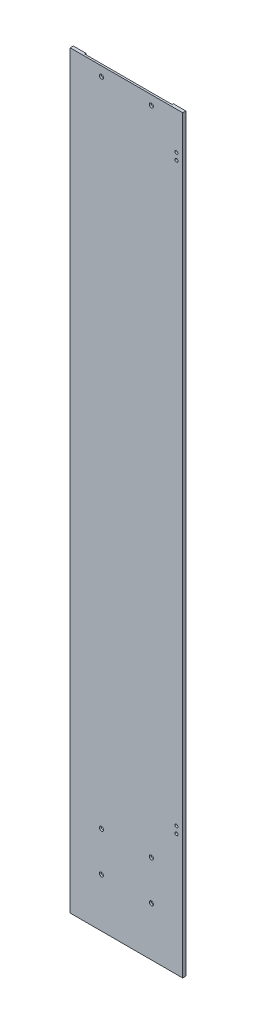
ISO-10303-21;
HEADER;
FILE_DESCRIPTION(('STEP AP214'),'2;1');
FILE_NAME('part.step','',(''),(''),'','','');
FILE_SCHEMA(('AUTOMOTIVE_DESIGN { 1 0 10303 214 1 1 1 1 }'));
ENDSEC;
DATA;
#1=APPLICATION_CONTEXT('core data for automotive mechanical design processes');
#2=APPLICATION_PROTOCOL_DEFINITION('international standard','automotive_design',2000,#1);
#3=PRODUCT_CONTEXT('',#1,'mechanical');
#4=PRODUCT('Part','Part','',(#3));
#5=PRODUCT_RELATED_PRODUCT_CATEGORY('part','',(#4));
#6=PRODUCT_DEFINITION_FORMATION('','',#4);
#7=PRODUCT_DEFINITION_CONTEXT('part definition',#1,'design');
#8=PRODUCT_DEFINITION('design','',#6,#7);
#9=PRODUCT_DEFINITION_SHAPE('','',#8);
#10=(LENGTH_UNIT() NAMED_UNIT(*) SI_UNIT(.MILLI.,.METRE.));
#11=(NAMED_UNIT(*) PLANE_ANGLE_UNIT() SI_UNIT($,.RADIAN.));
#12=(NAMED_UNIT(*) SI_UNIT($,.STERADIAN.) SOLID_ANGLE_UNIT());
#13=UNCERTAINTY_MEASURE_WITH_UNIT(LENGTH_MEASURE(1.E-05),#10,'distance_accuracy_value','');
#14=(GEOMETRIC_REPRESENTATION_CONTEXT(3) GLOBAL_UNCERTAINTY_ASSIGNED_CONTEXT((#13)) GLOBAL_UNIT_ASSIGNED_CONTEXT((#10,
#11,#12)) REPRESENTATION_CONTEXT('',''));
#15=CARTESIAN_POINT('',(0.,0.,0.));
#16=DIRECTION('',(0.,0.,1.));
#17=DIRECTION('',(1.,0.,0.));
#18=AXIS2_PLACEMENT_3D('',#15,#16,#17);
#19=CARTESIAN_POINT('',(0.,0.,0.));
#20=DIRECTION('',(0.,0.,1.));
#21=DIRECTION('',(1.,0.,0.));
#22=AXIS2_PLACEMENT_3D('',#19,#20,#21);
#23=PLANE('',#22);
#24=CARTESIAN_POINT('',(80.,539.95,0.));
#25=DIRECTION('',(0.,0.,-1.));
#26=DIRECTION('',(-1.,0.,0.));
#27=AXIS2_PLACEMENT_3D('',#24,#25,#26);
#28=CIRCLE('',#27,2.5);
#29=CARTESIAN_POINT('',(77.5,539.95,0.));
#30=VERTEX_POINT('',#29);
#31=EDGE_CURVE('E244',#30,#30,#28,.T.);
#32=ORIENTED_EDGE('',*,*,#31,.F.);
#33=EDGE_LOOP('',(#32));
#34=FACE_BOUND('',#33,.T.);
#35=CARTESIAN_POINT('',(80.,529.,0.));
#36=DIRECTION('',(0.,0.,-1.));
#37=DIRECTION('',(-1.,0.,0.));
#38=AXIS2_PLACEMENT_3D('',#35,#36,#37);
#39=CIRCLE('',#38,2.5);
#40=CARTESIAN_POINT('',(77.5,529.,0.));
#41=VERTEX_POINT('',#40);
#42=EDGE_CURVE('E238',#41,#41,#39,.T.);
#43=ORIENTED_EDGE('',*,*,#42,.F.);
#44=EDGE_LOOP('',(#43));
#45=FACE_BOUND('',#44,.T.);
#46=CARTESIAN_POINT('',(80.,-394.05,0.));
#47=DIRECTION('',(0.,0.,-1.));
#48=DIRECTION('',(-1.,0.,0.));
#49=AXIS2_PLACEMENT_3D('',#46,#47,#48);
#50=CIRCLE('',#49,2.50000000000001);
#51=CARTESIAN_POINT('',(77.5,-394.05,0.));
#52=VERTEX_POINT('',#51);
#53=EDGE_CURVE('E232',#52,#52,#50,.T.);
#54=ORIENTED_EDGE('',*,*,#53,.F.);
#55=EDGE_LOOP('',(#54));
#56=FACE_BOUND('',#55,.T.);
#57=CARTESIAN_POINT('',(80.,-405.,0.));
#58=DIRECTION('',(0.,0.,-1.));
#59=DIRECTION('',(-1.,0.,0.));
#60=AXIS2_PLACEMENT_3D('',#57,#58,#59);
#61=CIRCLE('',#60,2.5);
#62=CARTESIAN_POINT('',(77.5,-405.,0.));
#63=VERTEX_POINT('',#62);
#64=EDGE_CURVE('E226',#63,#63,#61,.T.);
#65=ORIENTED_EDGE('',*,*,#64,.F.);
#66=EDGE_LOOP('',(#65));
#67=FACE_BOUND('',#66,.T.);
#68=DIRECTION('',(1.,0.,0.));
#69=VECTOR('',#68,1.);
#70=CARTESIAN_POINT('',(-89.9999999999999,-600.,0.));
#71=LINE('',#70,#69);
#72=CARTESIAN_POINT('',(70.,-600.,0.));
#73=VERTEX_POINT('',#72);
#74=CARTESIAN_POINT('',(90.0000000000001,-600.,0.));
#75=VERTEX_POINT('',#74);
#76=EDGE_CURVE('E80',#73,#75,#71,.T.);
#77=ORIENTED_EDGE('',*,*,#76,.F.);
#78=DIRECTION('',(0.,-1.,0.));
#79=VECTOR('',#78,1.);
#80=CARTESIAN_POINT('',(70.,600.,0.));
#81=LINE('',#80,#79);
#82=CARTESIAN_POINT('',(70.,600.,0.));
#83=VERTEX_POINT('',#82);
#84=EDGE_CURVE('E113',#83,#73,#81,.T.);
#85=ORIENTED_EDGE('',*,*,#84,.F.);
#86=DIRECTION('',(-1.,0.,0.));
#87=VECTOR('',#86,1.);
#88=CARTESIAN_POINT('',(-90.0000000000001,600.,0.));
#89=LINE('',#88,#87);
#90=CARTESIAN_POINT('',(89.9999999999999,600.,0.));
#91=VERTEX_POINT('',#90);
#92=EDGE_CURVE('E154',#91,#83,#89,.T.);
#93=ORIENTED_EDGE('',*,*,#92,.F.);
#94=DIRECTION('',(0.,1.,0.));
#95=VECTOR('',#94,1.);
#96=CARTESIAN_POINT('',(89.9999999999999,600.,0.));
#97=LINE('',#96,#95);
#98=EDGE_CURVE('E138',#75,#91,#97,.T.);
#99=ORIENTED_EDGE('',*,*,#98,.F.);
#100=EDGE_LOOP('',(#77,#85,#93,#99));
#101=FACE_BOUND('',#100,.T.);
#102=ADVANCED_FACE('F33',(#34,#45,#56,#67,#101),#23,.F.);
#103=CARTESIAN_POINT('',(89.9999999999999,600.,5.));
#104=DIRECTION('',(-1.,0.,0.));
#105=DIRECTION('',(0.,-1.,0.));
#106=AXIS2_PLACEMENT_3D('',#103,#104,#105);
#107=PLANE('',#106);
#108=ORIENTED_EDGE('',*,*,#98,.T.);
#109=DIRECTION('',(0.,0.,-1.));
#110=VECTOR('',#109,1.);
#111=CARTESIAN_POINT('',(89.9999999999999,600.,5.));
#112=LINE('',#111,#110);
#113=CARTESIAN_POINT('',(89.9999999999999,600.,5.));
#114=VERTEX_POINT('',#113);
#115=EDGE_CURVE('E11',#114,#91,#112,.T.);
#116=ORIENTED_EDGE('',*,*,#115,.F.);
#117=DIRECTION('',(0.,1.,0.));
#118=VECTOR('',#117,1.);
#119=CARTESIAN_POINT('',(89.9999999999999,600.,5.));
#120=LINE('',#119,#118);
#121=CARTESIAN_POINT('',(90.0000000000001,-600.,5.));
#122=VERTEX_POINT('',#121);
#123=EDGE_CURVE('E143',#122,#114,#120,.T.);
#124=ORIENTED_EDGE('',*,*,#123,.F.);
#125=DIRECTION('',(0.,0.,-1.));
#126=VECTOR('',#125,1.);
#127=CARTESIAN_POINT('',(90.0000000000001,-600.,5.));
#128=LINE('',#127,#126);
#129=EDGE_CURVE('E150',#122,#75,#128,.T.);
#130=ORIENTED_EDGE('',*,*,#129,.T.);
#131=EDGE_LOOP('',(#108,#116,#124,#130));
#132=FACE_BOUND('',#131,.T.);
#133=ADVANCED_FACE('F35',(#132),#107,.F.);
#134=CARTESIAN_POINT('',(-90.0000000000001,600.,5.));
#135=DIRECTION('',(0.,-1.,0.));
#136=DIRECTION('',(0.,0.,-1.));
#137=AXIS2_PLACEMENT_3D('',#134,#135,#136);
#138=PLANE('',#137);
#139=ORIENTED_EDGE('',*,*,#92,.T.);
#140=DIRECTION('',(0.,0.,-1.));
#141=VECTOR('',#140,1.);
#142=CARTESIAN_POINT('',(70.,600.,2.));
#143=LINE('',#142,#141);
#144=CARTESIAN_POINT('',(70.,600.,2.));
#145=VERTEX_POINT('',#144);
#146=EDGE_CURVE('E136',#145,#83,#143,.T.);
#147=ORIENTED_EDGE('',*,*,#146,.F.);
#148=DIRECTION('',(1.,0.,0.));
#149=VECTOR('',#148,1.);
#150=CARTESIAN_POINT('',(70.,600.,2.));
#151=LINE('',#150,#149);
#152=CARTESIAN_POINT('',(-70.,600.,2.));
#153=VERTEX_POINT('',#152);
#154=EDGE_CURVE('E115',#153,#145,#151,.T.);
#155=ORIENTED_EDGE('',*,*,#154,.F.);
#156=DIRECTION('',(0.,0.,-1.));
#157=VECTOR('',#156,1.);
#158=CARTESIAN_POINT('',(-70.,600.,2.));
#159=LINE('',#158,#157);
#160=CARTESIAN_POINT('',(-70.,600.,0.));
#161=VERTEX_POINT('',#160);
#162=EDGE_CURVE('E139',#153,#161,#159,.T.);
#163=ORIENTED_EDGE('',*,*,#162,.T.);
#164=CARTESIAN_POINT('',(-90.0000000000001,600.,0.));
#165=VERTEX_POINT('',#164);
#166=EDGE_CURVE('E153',#161,#165,#89,.T.);
#167=ORIENTED_EDGE('',*,*,#166,.T.);
#168=DIRECTION('',(0.,0.,-1.));
#169=VECTOR('',#168,1.);
#170=CARTESIAN_POINT('',(-90.0000000000001,600.,5.));
#171=LINE('',#170,#169);
#172=CARTESIAN_POINT('',(-90.0000000000001,600.,5.));
#173=VERTEX_POINT('',#172);
#174=EDGE_CURVE('E42',#173,#165,#171,.T.);
#175=ORIENTED_EDGE('',*,*,#174,.F.);
#176=DIRECTION('',(-1.,0.,0.));
#177=VECTOR('',#176,1.);
#178=CARTESIAN_POINT('',(-90.0000000000001,600.,5.));
#179=LINE('',#178,#177);
#180=EDGE_CURVE('E87',#114,#173,#179,.T.);
#181=ORIENTED_EDGE('',*,*,#180,.F.);
#182=ORIENTED_EDGE('',*,*,#115,.T.);
#183=EDGE_LOOP('',(#139,#147,#155,#163,#167,#175,#181,#182));
#184=FACE_BOUND('',#183,.T.);
#185=ADVANCED_FACE('F281',(#184),#138,.F.);
#186=CARTESIAN_POINT('',(-90.0000000000001,600.,5.));
#187=DIRECTION('',(1.,0.,0.));
#188=DIRECTION('',(0.,1.,0.));
#189=AXIS2_PLACEMENT_3D('',#186,#187,#188);
#190=PLANE('',#189);
#191=DIRECTION('',(0.,-1.,0.));
#192=VECTOR('',#191,1.);
#193=CARTESIAN_POINT('',(-90.0000000000001,600.,0.));
#194=LINE('',#193,#192);
#195=CARTESIAN_POINT('',(-89.9999999999999,-600.,0.));
#196=VERTEX_POINT('',#195);
#197=EDGE_CURVE('E157',#165,#196,#194,.T.);
#198=ORIENTED_EDGE('',*,*,#197,.T.);
#199=DIRECTION('',(0.,0.,-1.));
#200=VECTOR('',#199,1.);
#201=CARTESIAN_POINT('',(-89.9999999999999,-600.,5.));
#202=LINE('',#201,#200);
#203=CARTESIAN_POINT('',(-89.9999999999999,-600.,5.));
#204=VERTEX_POINT('',#203);
#205=EDGE_CURVE('E161',#204,#196,#202,.T.);
#206=ORIENTED_EDGE('',*,*,#205,.F.);
#207=DIRECTION('',(0.,-1.,0.));
#208=VECTOR('',#207,1.);
#209=CARTESIAN_POINT('',(-90.0000000000001,600.,5.));
#210=LINE('',#209,#208);
#211=EDGE_CURVE('E147',#173,#204,#210,.T.);
#212=ORIENTED_EDGE('',*,*,#211,.F.);
#213=ORIENTED_EDGE('',*,*,#174,.T.);
#214=EDGE_LOOP('',(#198,#206,#212,#213));
#215=FACE_BOUND('',#214,.T.);
#216=ADVANCED_FACE('F282',(#215),#190,.F.);
#217=CARTESIAN_POINT('',(-89.9999999999999,-600.,5.));
#218=DIRECTION('',(0.,1.,0.));
#219=DIRECTION('',(0.,0.,1.));
#220=AXIS2_PLACEMENT_3D('',#217,#218,#219);
#221=PLANE('',#220);
#222=DIRECTION('',(-1.,0.,0.));
#223=VECTOR('',#222,1.);
#224=CARTESIAN_POINT('',(70.,-600.,2.));
#225=LINE('',#224,#223);
#226=CARTESIAN_POINT('',(70.,-600.,2.));
#227=VERTEX_POINT('',#226);
#228=CARTESIAN_POINT('',(-70.,-600.,2.));
#229=VERTEX_POINT('',#228);
#230=EDGE_CURVE('E121',#227,#229,#225,.T.);
#231=ORIENTED_EDGE('',*,*,#230,.F.);
#232=DIRECTION('',(0.,0.,-1.));
#233=VECTOR('',#232,1.);
#234=CARTESIAN_POINT('',(70.,-600.,2.));
#235=LINE('',#234,#233);
#236=EDGE_CURVE('E107',#227,#73,#235,.T.);
#237=ORIENTED_EDGE('',*,*,#236,.T.);
#238=ORIENTED_EDGE('',*,*,#76,.T.);
#239=ORIENTED_EDGE('',*,*,#129,.F.);
#240=DIRECTION('',(1.,0.,0.));
#241=VECTOR('',#240,1.);
#242=CARTESIAN_POINT('',(-89.9999999999999,-600.,5.));
#243=LINE('',#242,#241);
#244=EDGE_CURVE('E59',#204,#122,#243,.T.);
#245=ORIENTED_EDGE('',*,*,#244,.F.);
#246=ORIENTED_EDGE('',*,*,#205,.T.);
#247=CARTESIAN_POINT('',(-70.,-600.,0.));
#248=VERTEX_POINT('',#247);
#249=EDGE_CURVE('E145',#196,#248,#71,.T.);
#250=ORIENTED_EDGE('',*,*,#249,.T.);
#251=DIRECTION('',(0.,0.,-1.));
#252=VECTOR('',#251,1.);
#253=CARTESIAN_POINT('',(-70.,-600.,2.));
#254=LINE('',#253,#252);
#255=EDGE_CURVE('E50',#229,#248,#254,.T.);
#256=ORIENTED_EDGE('',*,*,#255,.F.);
#257=EDGE_LOOP('',(#231,#237,#238,#239,#245,#246,#250,#256));
#258=FACE_BOUND('',#257,.T.);
#259=ADVANCED_FACE('F126',(#258),#221,.F.);
#260=CARTESIAN_POINT('',(0.,0.,5.));
#261=DIRECTION('',(0.,0.,1.));
#262=DIRECTION('',(1.,0.,0.));
#263=AXIS2_PLACEMENT_3D('',#260,#261,#262);
#264=PLANE('',#263);
#265=CARTESIAN_POINT('',(80.,539.95,5.));
#266=DIRECTION('',(0.,0.,-1.));
#267=DIRECTION('',(-1.,0.,0.));
#268=AXIS2_PLACEMENT_3D('',#265,#266,#267);
#269=CIRCLE('',#268,2.5);
#270=CARTESIAN_POINT('',(77.5,539.95,5.));
#271=VERTEX_POINT('',#270);
#272=EDGE_CURVE('E218',#271,#271,#269,.T.);
#273=ORIENTED_EDGE('',*,*,#272,.T.);
#274=EDGE_LOOP('',(#273));
#275=FACE_BOUND('',#274,.T.);
#276=CARTESIAN_POINT('',(80.,529.,5.));
#277=DIRECTION('',(0.,0.,-1.));
#278=DIRECTION('',(-1.,0.,0.));
#279=AXIS2_PLACEMENT_3D('',#276,#277,#278);
#280=CIRCLE('',#279,2.5);
#281=CARTESIAN_POINT('',(77.5,529.,5.));
#282=VERTEX_POINT('',#281);
#283=EDGE_CURVE('E241',#282,#282,#280,.T.);
#284=ORIENTED_EDGE('',*,*,#283,.T.);
#285=EDGE_LOOP('',(#284));
#286=FACE_BOUND('',#285,.T.);
#287=CARTESIAN_POINT('',(80.,-394.05,5.));
#288=DIRECTION('',(0.,0.,-1.));
#289=DIRECTION('',(-1.,0.,0.));
#290=AXIS2_PLACEMENT_3D('',#287,#288,#289);
#291=CIRCLE('',#290,2.50000000000001);
#292=CARTESIAN_POINT('',(77.5,-394.05,5.));
#293=VERTEX_POINT('',#292);
#294=EDGE_CURVE('E235',#293,#293,#291,.T.);
#295=ORIENTED_EDGE('',*,*,#294,.T.);
#296=EDGE_LOOP('',(#295));
#297=FACE_BOUND('',#296,.T.);
#298=CARTESIAN_POINT('',(80.,-405.,5.));
#299=DIRECTION('',(0.,0.,-1.));
#300=DIRECTION('',(-1.,0.,0.));
#301=AXIS2_PLACEMENT_3D('',#298,#299,#300);
#302=CIRCLE('',#301,2.5);
#303=CARTESIAN_POINT('',(77.5,-405.,5.));
#304=VERTEX_POINT('',#303);
#305=EDGE_CURVE('E229',#304,#304,#302,.T.);
#306=ORIENTED_EDGE('',*,*,#305,.T.);
#307=EDGE_LOOP('',(#306));
#308=FACE_BOUND('',#307,.T.);
#309=CARTESIAN_POINT('',(40.,-521.5,5.));
#310=DIRECTION('',(0.,0.,1.));
#311=DIRECTION('',(-1.,0.,0.));
#312=AXIS2_PLACEMENT_3D('',#309,#310,#311);
#313=CIRCLE('',#312,3.30000000000002);
#314=CARTESIAN_POINT('',(36.7,-521.5,5.));
#315=VERTEX_POINT('',#314);
#316=EDGE_CURVE('E214',#315,#315,#313,.T.);
#317=ORIENTED_EDGE('',*,*,#316,.F.);
#318=EDGE_LOOP('',(#317));
#319=FACE_BOUND('',#318,.T.);
#320=CARTESIAN_POINT('',(40.,-458.,5.));
#321=DIRECTION('',(0.,0.,1.));
#322=DIRECTION('',(-1.,0.,0.));
#323=AXIS2_PLACEMENT_3D('',#320,#321,#322);
#324=CIRCLE('',#323,3.30000000000002);
#325=CARTESIAN_POINT('',(36.7,-458.,5.));
#326=VERTEX_POINT('',#325);
#327=EDGE_CURVE('E217',#326,#326,#324,.T.);
#328=ORIENTED_EDGE('',*,*,#327,.F.);
#329=EDGE_LOOP('',(#328));
#330=FACE_BOUND('',#329,.T.);
#331=CARTESIAN_POINT('',(40.,585.,5.));
#332=DIRECTION('',(0.,0.,1.));
#333=DIRECTION('',(-1.,0.,0.));
#334=AXIS2_PLACEMENT_3D('',#331,#332,#333);
#335=CIRCLE('',#334,3.30000000000002);
#336=CARTESIAN_POINT('',(36.7,585.,5.));
#337=VERTEX_POINT('',#336);
#338=EDGE_CURVE('E221',#337,#337,#335,.T.);
#339=ORIENTED_EDGE('',*,*,#338,.F.);
#340=EDGE_LOOP('',(#339));
#341=FACE_BOUND('',#340,.T.);
#342=CARTESIAN_POINT('',(-40.,585.,5.));
#343=DIRECTION('',(0.,0.,1.));
#344=DIRECTION('',(1.,0.,0.));
#345=AXIS2_PLACEMENT_3D('',#342,#343,#344);
#346=CIRCLE('',#345,3.30000000000002);
#347=CARTESIAN_POINT('',(-36.7,585.,5.));
#348=VERTEX_POINT('',#347);
#349=EDGE_CURVE('E211',#348,#348,#346,.T.);
#350=ORIENTED_EDGE('',*,*,#349,.F.);
#351=EDGE_LOOP('',(#350));
#352=FACE_BOUND('',#351,.T.);
#353=CARTESIAN_POINT('',(-40.,-458.,5.));
#354=DIRECTION('',(0.,0.,1.));
#355=DIRECTION('',(1.,0.,0.));
#356=AXIS2_PLACEMENT_3D('',#353,#354,#355);
#357=CIRCLE('',#356,3.30000000000002);
#358=CARTESIAN_POINT('',(-36.7,-458.,5.));
#359=VERTEX_POINT('',#358);
#360=EDGE_CURVE('E209',#359,#359,#357,.T.);
#361=ORIENTED_EDGE('',*,*,#360,.F.);
#362=EDGE_LOOP('',(#361));
#363=FACE_BOUND('',#362,.T.);
#364=CARTESIAN_POINT('',(-40.,-521.5,5.));
#365=DIRECTION('',(0.,0.,1.));
#366=DIRECTION('',(1.,0.,0.));
#367=AXIS2_PLACEMENT_3D('',#364,#365,#366);
#368=CIRCLE('',#367,3.30000000000002);
#369=CARTESIAN_POINT('',(-36.7,-521.5,5.));
#370=VERTEX_POINT('',#369);
#371=EDGE_CURVE('E170',#370,#370,#368,.T.);
#372=ORIENTED_EDGE('',*,*,#371,.F.);
#373=EDGE_LOOP('',(#372));
#374=FACE_BOUND('',#373,.T.);
#375=ORIENTED_EDGE('',*,*,#123,.T.);
#376=ORIENTED_EDGE('',*,*,#180,.T.);
#377=ORIENTED_EDGE('',*,*,#211,.T.);
#378=ORIENTED_EDGE('',*,*,#244,.T.);
#379=EDGE_LOOP('',(#375,#376,#377,#378));
#380=FACE_BOUND('',#379,.T.);
#381=ADVANCED_FACE('F250',(#275,#286,#297,#308,#319,#330,#341,#352,#363,#374,#380),#264,.T.);
#382=ORIENTED_EDGE('',*,*,#166,.F.);
#383=DIRECTION('',(0.,1.,0.));
#384=VECTOR('',#383,1.);
#385=CARTESIAN_POINT('',(-70.,600.,0.));
#386=LINE('',#385,#384);
#387=EDGE_CURVE('E124',#248,#161,#386,.T.);
#388=ORIENTED_EDGE('',*,*,#387,.F.);
#389=ORIENTED_EDGE('',*,*,#249,.F.);
#390=ORIENTED_EDGE('',*,*,#197,.F.);
#391=EDGE_LOOP('',(#382,#388,#389,#390));
#392=FACE_BOUND('',#391,.T.);
#393=ADVANCED_FACE('F263',(#392),#23,.F.);
#394=CARTESIAN_POINT('',(70.,600.,2.));
#395=DIRECTION('',(1.,0.,0.));
#396=DIRECTION('',(0.,0.,-1.));
#397=AXIS2_PLACEMENT_3D('',#394,#395,#396);
#398=PLANE('',#397);
#399=ORIENTED_EDGE('',*,*,#84,.T.);
#400=ORIENTED_EDGE('',*,*,#236,.F.);
#401=DIRECTION('',(0.,-1.,0.));
#402=VECTOR('',#401,1.);
#403=CARTESIAN_POINT('',(70.,600.,2.));
#404=LINE('',#403,#402);
#405=EDGE_CURVE('E110',#145,#227,#404,.T.);
#406=ORIENTED_EDGE('',*,*,#405,.F.);
#407=ORIENTED_EDGE('',*,*,#146,.T.);
#408=EDGE_LOOP('',(#399,#400,#406,#407));
#409=FACE_BOUND('',#408,.T.);
#410=ADVANCED_FACE('F109',(#409),#398,.F.);
#411=CARTESIAN_POINT('',(-70.,600.,2.));
#412=DIRECTION('',(-1.,0.,0.));
#413=DIRECTION('',(0.,0.,1.));
#414=AXIS2_PLACEMENT_3D('',#411,#412,#413);
#415=PLANE('',#414);
#416=ORIENTED_EDGE('',*,*,#387,.T.);
#417=ORIENTED_EDGE('',*,*,#162,.F.);
#418=DIRECTION('',(0.,1.,0.));
#419=VECTOR('',#418,1.);
#420=CARTESIAN_POINT('',(-70.,600.,2.));
#421=LINE('',#420,#419);
#422=EDGE_CURVE('E128',#229,#153,#421,.T.);
#423=ORIENTED_EDGE('',*,*,#422,.F.);
#424=ORIENTED_EDGE('',*,*,#255,.T.);
#425=EDGE_LOOP('',(#416,#417,#423,#424));
#426=FACE_BOUND('',#425,.T.);
#427=ADVANCED_FACE('F191',(#426),#415,.F.);
#428=CARTESIAN_POINT('',(0.,0.,2.));
#429=DIRECTION('',(0.,0.,-1.));
#430=DIRECTION('',(-1.,0.,0.));
#431=AXIS2_PLACEMENT_3D('',#428,#429,#430);
#432=PLANE('',#431);
#433=CARTESIAN_POINT('',(40.,-521.5,2.));
#434=DIRECTION('',(0.,0.,-1.));
#435=DIRECTION('',(-1.,0.,0.));
#436=AXIS2_PLACEMENT_3D('',#433,#434,#435);
#437=CIRCLE('',#436,3.30000000000002);
#438=CARTESIAN_POINT('',(36.7,-521.5,2.));
#439=VERTEX_POINT('',#438);
#440=EDGE_CURVE('E37',#439,#439,#437,.T.);
#441=ORIENTED_EDGE('',*,*,#440,.F.);
#442=EDGE_LOOP('',(#441));
#443=FACE_BOUND('',#442,.T.);
#444=CARTESIAN_POINT('',(40.,-458.,2.));
#445=DIRECTION('',(0.,0.,-1.));
#446=DIRECTION('',(-1.,0.,0.));
#447=AXIS2_PLACEMENT_3D('',#444,#445,#446);
#448=CIRCLE('',#447,3.30000000000002);
#449=CARTESIAN_POINT('',(36.7,-458.,2.));
#450=VERTEX_POINT('',#449);
#451=EDGE_CURVE('E178',#450,#450,#448,.T.);
#452=ORIENTED_EDGE('',*,*,#451,.F.);
#453=EDGE_LOOP('',(#452));
#454=FACE_BOUND('',#453,.T.);
#455=CARTESIAN_POINT('',(40.,585.,2.));
#456=DIRECTION('',(0.,0.,-1.));
#457=DIRECTION('',(-1.,0.,0.));
#458=AXIS2_PLACEMENT_3D('',#455,#456,#457);
#459=CIRCLE('',#458,3.30000000000002);
#460=CARTESIAN_POINT('',(36.7,585.,2.));
#461=VERTEX_POINT('',#460);
#462=EDGE_CURVE('E176',#461,#461,#459,.T.);
#463=ORIENTED_EDGE('',*,*,#462,.F.);
#464=EDGE_LOOP('',(#463));
#465=FACE_BOUND('',#464,.T.);
#466=CARTESIAN_POINT('',(-40.,585.,2.));
#467=DIRECTION('',(0.,0.,-1.));
#468=DIRECTION('',(-1.,0.,0.));
#469=AXIS2_PLACEMENT_3D('',#466,#467,#468);
#470=CIRCLE('',#469,3.30000000000002);
#471=CARTESIAN_POINT('',(-43.3,585.,2.));
#472=VERTEX_POINT('',#471);
#473=EDGE_CURVE('E173',#472,#472,#470,.T.);
#474=ORIENTED_EDGE('',*,*,#473,.F.);
#475=EDGE_LOOP('',(#474));
#476=FACE_BOUND('',#475,.T.);
#477=CARTESIAN_POINT('',(-40.,-458.,2.));
#478=DIRECTION('',(0.,0.,-1.));
#479=DIRECTION('',(-1.,0.,0.));
#480=AXIS2_PLACEMENT_3D('',#477,#478,#479);
#481=CIRCLE('',#480,3.30000000000002);
#482=CARTESIAN_POINT('',(-43.3,-458.,2.));
#483=VERTEX_POINT('',#482);
#484=EDGE_CURVE('E169',#483,#483,#481,.T.);
#485=ORIENTED_EDGE('',*,*,#484,.F.);
#486=EDGE_LOOP('',(#485));
#487=FACE_BOUND('',#486,.T.);
#488=CARTESIAN_POINT('',(-40.,-521.5,2.));
#489=DIRECTION('',(0.,0.,-1.));
#490=DIRECTION('',(-1.,0.,0.));
#491=AXIS2_PLACEMENT_3D('',#488,#489,#490);
#492=CIRCLE('',#491,3.30000000000002);
#493=CARTESIAN_POINT('',(-43.3,-521.5,2.));
#494=VERTEX_POINT('',#493);
#495=EDGE_CURVE('E166',#494,#494,#492,.T.);
#496=ORIENTED_EDGE('',*,*,#495,.F.);
#497=EDGE_LOOP('',(#496));
#498=FACE_BOUND('',#497,.T.);
#499=ORIENTED_EDGE('',*,*,#405,.T.);
#500=ORIENTED_EDGE('',*,*,#230,.T.);
#501=ORIENTED_EDGE('',*,*,#422,.T.);
#502=ORIENTED_EDGE('',*,*,#154,.T.);
#503=EDGE_LOOP('',(#499,#500,#501,#502));
#504=FACE_BOUND('',#503,.T.);
#505=ADVANCED_FACE('F119',(#443,#454,#465,#476,#487,#498,#504),#432,.T.);
#506=CARTESIAN_POINT('',(-40.,-521.5,0.));
#507=DIRECTION('',(0.,0.,1.));
#508=DIRECTION('',(1.,0.,0.));
#509=AXIS2_PLACEMENT_3D('',#506,#507,#508);
#510=CYLINDRICAL_SURFACE('',#509,3.30000000000002);
#511=ORIENTED_EDGE('',*,*,#495,.T.);
#512=EDGE_LOOP('',(#511));
#513=FACE_BOUND('',#512,.T.);
#514=ORIENTED_EDGE('',*,*,#371,.T.);
#515=EDGE_LOOP('',(#514));
#516=FACE_BOUND('',#515,.T.);
#517=ADVANCED_FACE('F190',(#513,#516),#510,.F.);
#518=CARTESIAN_POINT('',(-40.,-458.,0.));
#519=DIRECTION('',(0.,0.,1.));
#520=DIRECTION('',(1.,0.,0.));
#521=AXIS2_PLACEMENT_3D('',#518,#519,#520);
#522=CYLINDRICAL_SURFACE('',#521,3.30000000000002);
#523=ORIENTED_EDGE('',*,*,#484,.T.);
#524=EDGE_LOOP('',(#523));
#525=FACE_BOUND('',#524,.T.);
#526=ORIENTED_EDGE('',*,*,#360,.T.);
#527=EDGE_LOOP('',(#526));
#528=FACE_BOUND('',#527,.T.);
#529=ADVANCED_FACE('F204',(#525,#528),#522,.F.);
#530=CARTESIAN_POINT('',(-40.,585.,0.));
#531=DIRECTION('',(0.,0.,1.));
#532=DIRECTION('',(1.,0.,0.));
#533=AXIS2_PLACEMENT_3D('',#530,#531,#532);
#534=CYLINDRICAL_SURFACE('',#533,3.30000000000002);
#535=ORIENTED_EDGE('',*,*,#473,.T.);
#536=EDGE_LOOP('',(#535));
#537=FACE_BOUND('',#536,.T.);
#538=ORIENTED_EDGE('',*,*,#349,.T.);
#539=EDGE_LOOP('',(#538));
#540=FACE_BOUND('',#539,.T.);
#541=ADVANCED_FACE('F338',(#537,#540),#534,.F.);
#542=CARTESIAN_POINT('',(40.,585.,0.));
#543=DIRECTION('',(0.,0.,1.));
#544=DIRECTION('',(1.,0.,0.));
#545=AXIS2_PLACEMENT_3D('',#542,#543,#544);
#546=CYLINDRICAL_SURFACE('',#545,3.30000000000002);
#547=ORIENTED_EDGE('',*,*,#462,.T.);
#548=EDGE_LOOP('',(#547));
#549=FACE_BOUND('',#548,.T.);
#550=ORIENTED_EDGE('',*,*,#338,.T.);
#551=EDGE_LOOP('',(#550));
#552=FACE_BOUND('',#551,.T.);
#553=ADVANCED_FACE('F329',(#549,#552),#546,.F.);
#554=CARTESIAN_POINT('',(40.,-458.,0.));
#555=DIRECTION('',(0.,0.,1.));
#556=DIRECTION('',(1.,0.,0.));
#557=AXIS2_PLACEMENT_3D('',#554,#555,#556);
#558=CYLINDRICAL_SURFACE('',#557,3.30000000000002);
#559=ORIENTED_EDGE('',*,*,#451,.T.);
#560=EDGE_LOOP('',(#559));
#561=FACE_BOUND('',#560,.T.);
#562=ORIENTED_EDGE('',*,*,#327,.T.);
#563=EDGE_LOOP('',(#562));
#564=FACE_BOUND('',#563,.T.);
#565=ADVANCED_FACE('F318',(#561,#564),#558,.F.);
#566=CARTESIAN_POINT('',(40.,-521.5,0.));
#567=DIRECTION('',(0.,0.,1.));
#568=DIRECTION('',(1.,0.,0.));
#569=AXIS2_PLACEMENT_3D('',#566,#567,#568);
#570=CYLINDRICAL_SURFACE('',#569,3.30000000000002);
#571=ORIENTED_EDGE('',*,*,#440,.T.);
#572=EDGE_LOOP('',(#571));
#573=FACE_BOUND('',#572,.T.);
#574=ORIENTED_EDGE('',*,*,#316,.T.);
#575=EDGE_LOOP('',(#574));
#576=FACE_BOUND('',#575,.T.);
#577=ADVANCED_FACE('F185',(#573,#576),#570,.F.);
#578=CARTESIAN_POINT('',(80.,-405.,5.));
#579=DIRECTION('',(0.,0.,-1.));
#580=DIRECTION('',(-1.,0.,0.));
#581=AXIS2_PLACEMENT_3D('',#578,#579,#580);
#582=CYLINDRICAL_SURFACE('',#581,2.5);
#583=ORIENTED_EDGE('',*,*,#305,.F.);
#584=EDGE_LOOP('',(#583));
#585=FACE_BOUND('',#584,.T.);
#586=ORIENTED_EDGE('',*,*,#64,.T.);
#587=EDGE_LOOP('',(#586));
#588=FACE_BOUND('',#587,.T.);
#589=ADVANCED_FACE('F317',(#585,#588),#582,.F.);
#590=CARTESIAN_POINT('',(80.,-394.05,5.));
#591=DIRECTION('',(0.,0.,-1.));
#592=DIRECTION('',(-1.,0.,0.));
#593=AXIS2_PLACEMENT_3D('',#590,#591,#592);
#594=CYLINDRICAL_SURFACE('',#593,2.50000000000001);
#595=ORIENTED_EDGE('',*,*,#294,.F.);
#596=EDGE_LOOP('',(#595));
#597=FACE_BOUND('',#596,.T.);
#598=ORIENTED_EDGE('',*,*,#53,.T.);
#599=EDGE_LOOP('',(#598));
#600=FACE_BOUND('',#599,.T.);
#601=ADVANCED_FACE('F414',(#597,#600),#594,.F.);
#602=CARTESIAN_POINT('',(80.,529.,5.));
#603=DIRECTION('',(0.,0.,-1.));
#604=DIRECTION('',(-1.,0.,0.));
#605=AXIS2_PLACEMENT_3D('',#602,#603,#604);
#606=CYLINDRICAL_SURFACE('',#605,2.5);
#607=ORIENTED_EDGE('',*,*,#283,.F.);
#608=EDGE_LOOP('',(#607));
#609=FACE_BOUND('',#608,.T.);
#610=ORIENTED_EDGE('',*,*,#42,.T.);
#611=EDGE_LOOP('',(#610));
#612=FACE_BOUND('',#611,.T.);
#613=ADVANCED_FACE('F256',(#609,#612),#606,.F.);
#614=CARTESIAN_POINT('',(80.,539.95,5.));
#615=DIRECTION('',(0.,0.,-1.));
#616=DIRECTION('',(-1.,0.,0.));
#617=AXIS2_PLACEMENT_3D('',#614,#615,#616);
#618=CYLINDRICAL_SURFACE('',#617,2.5);
#619=ORIENTED_EDGE('',*,*,#272,.F.);
#620=EDGE_LOOP('',(#619));
#621=FACE_BOUND('',#620,.T.);
#622=ORIENTED_EDGE('',*,*,#31,.T.);
#623=EDGE_LOOP('',(#622));
#624=FACE_BOUND('',#623,.T.);
#625=ADVANCED_FACE('F253',(#621,#624),#618,.F.);
#626=CLOSED_SHELL('',(#102,#133,#185,#216,#259,#381,#393,#410,#427,#505,#517,#529,#541,#553,
#565,#577,#589,#601,#613,#625));
#627=MANIFOLD_SOLID_BREP('B2',#626);
#628=ADVANCED_BREP_SHAPE_REPRESENTATION('',(#18,#627),#14);
#629=SHAPE_DEFINITION_REPRESENTATION(#9,#628);
ENDSEC;
END-ISO-10303-21;
